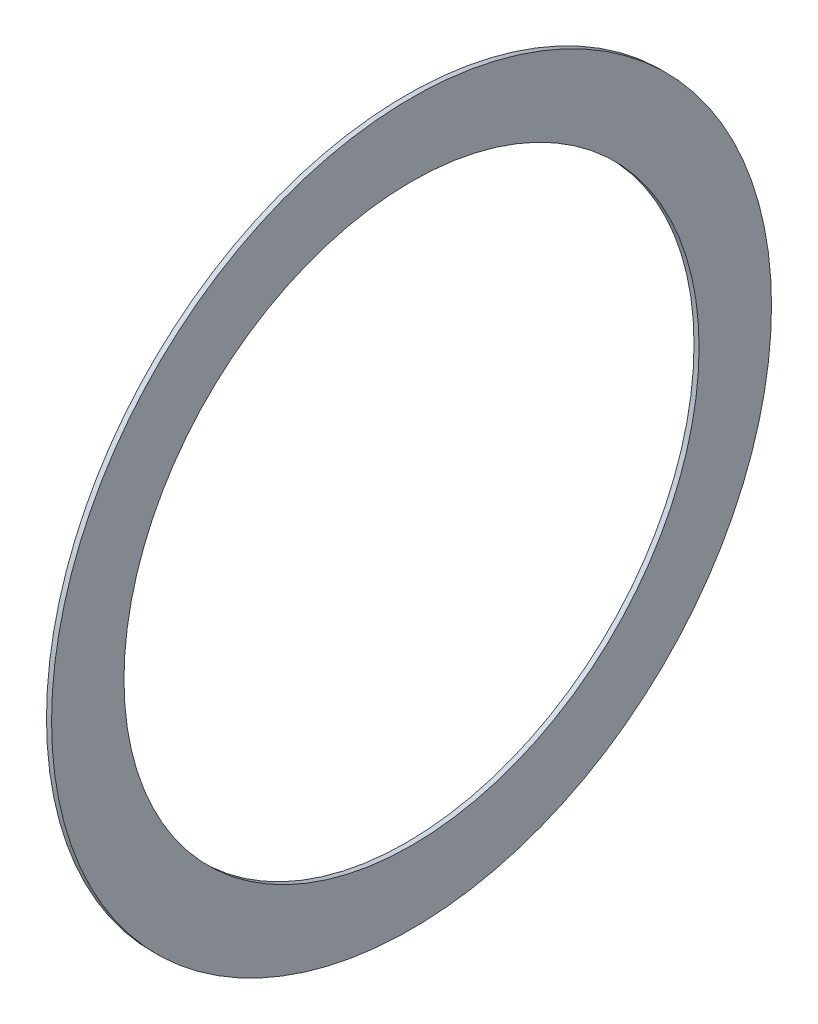
ISO-10303-21;
HEADER;
FILE_DESCRIPTION(('STEP AP214'),'2;1');
FILE_NAME('part.step','',(''),(''),'','','');
FILE_SCHEMA(('AUTOMOTIVE_DESIGN { 1 0 10303 214 1 1 1 1 }'));
ENDSEC;
DATA;
#1=APPLICATION_CONTEXT('core data for automotive mechanical design processes');
#2=APPLICATION_PROTOCOL_DEFINITION('international standard','automotive_design',2000,#1);
#3=PRODUCT_CONTEXT('',#1,'mechanical');
#4=PRODUCT('Part','Part','',(#3));
#5=PRODUCT_RELATED_PRODUCT_CATEGORY('part','',(#4));
#6=PRODUCT_DEFINITION_FORMATION('','',#4);
#7=PRODUCT_DEFINITION_CONTEXT('part definition',#1,'design');
#8=PRODUCT_DEFINITION('design','',#6,#7);
#9=PRODUCT_DEFINITION_SHAPE('','',#8);
#10=(LENGTH_UNIT() NAMED_UNIT(*) SI_UNIT(.MILLI.,.METRE.));
#11=(NAMED_UNIT(*) PLANE_ANGLE_UNIT() SI_UNIT($,.RADIAN.));
#12=(NAMED_UNIT(*) SI_UNIT($,.STERADIAN.) SOLID_ANGLE_UNIT());
#13=UNCERTAINTY_MEASURE_WITH_UNIT(LENGTH_MEASURE(1.E-05),#10,'distance_accuracy_value','');
#14=(GEOMETRIC_REPRESENTATION_CONTEXT(3) GLOBAL_UNCERTAINTY_ASSIGNED_CONTEXT((#13)) GLOBAL_UNIT_ASSIGNED_CONTEXT((#10,
#11,#12)) REPRESENTATION_CONTEXT('',''));
#15=CARTESIAN_POINT('',(0.,0.,0.));
#16=DIRECTION('',(0.,0.,1.));
#17=DIRECTION('',(1.,0.,0.));
#18=AXIS2_PLACEMENT_3D('',#15,#16,#17);
#19=CARTESIAN_POINT('',(0.2415,0.,0.));
#20=DIRECTION('',(1.,0.,0.));
#21=DIRECTION('',(0.,0.,-1.));
#22=AXIS2_PLACEMENT_3D('',#19,#20,#21);
#23=CYLINDRICAL_SURFACE('',#22,17.15);
#24=CARTESIAN_POINT('',(0.2415,0.,0.));
#25=DIRECTION('',(1.,0.,0.));
#26=DIRECTION('',(0.,0.,-1.));
#27=AXIS2_PLACEMENT_3D('',#24,#25,#26);
#28=CIRCLE('',#27,17.15);
#29=CARTESIAN_POINT('',(0.2415,0.,-17.15));
#30=VERTEX_POINT('',#29);
#31=EDGE_CURVE('E11',#30,#30,#28,.T.);
#32=ORIENTED_EDGE('',*,*,#31,.F.);
#33=EDGE_LOOP('',(#32));
#34=FACE_BOUND('',#33,.T.);
#35=CARTESIAN_POINT('',(0.,0.,0.));
#36=DIRECTION('',(1.,0.,0.));
#37=DIRECTION('',(0.,0.,-1.));
#38=AXIS2_PLACEMENT_3D('',#35,#36,#37);
#39=CIRCLE('',#38,17.15);
#40=CARTESIAN_POINT('',(0.,0.,-17.15));
#41=VERTEX_POINT('',#40);
#42=EDGE_CURVE('E45',#41,#41,#39,.T.);
#43=ORIENTED_EDGE('',*,*,#42,.T.);
#44=EDGE_LOOP('',(#43));
#45=FACE_BOUND('',#44,.T.);
#46=ADVANCED_FACE('F16',(#34,#45),#23,.T.);
#47=CARTESIAN_POINT('',(0.2415,13.7,0.));
#48=DIRECTION('',(1.,0.,0.));
#49=DIRECTION('',(0.,1.,0.));
#50=AXIS2_PLACEMENT_3D('',#47,#48,#49);
#51=PLANE('',#50);
#52=CARTESIAN_POINT('',(0.2415,0.,0.));
#53=DIRECTION('',(1.,0.,0.));
#54=DIRECTION('',(0.,0.,-1.));
#55=AXIS2_PLACEMENT_3D('',#52,#53,#54);
#56=CIRCLE('',#55,13.7);
#57=CARTESIAN_POINT('',(0.2415,0.,-13.7));
#58=VERTEX_POINT('',#57);
#59=EDGE_CURVE('E25',#58,#58,#56,.T.);
#60=ORIENTED_EDGE('',*,*,#59,.F.);
#61=EDGE_LOOP('',(#60));
#62=FACE_BOUND('',#61,.T.);
#63=ORIENTED_EDGE('',*,*,#31,.T.);
#64=EDGE_LOOP('',(#63));
#65=FACE_BOUND('',#64,.T.);
#66=ADVANCED_FACE('F65',(#62,#65),#51,.T.);
#67=CARTESIAN_POINT('',(0.2415,0.,0.));
#68=DIRECTION('',(1.,0.,0.));
#69=DIRECTION('',(0.,0.,-1.));
#70=AXIS2_PLACEMENT_3D('',#67,#68,#69);
#71=CYLINDRICAL_SURFACE('',#70,13.7);
#72=CARTESIAN_POINT('',(0.,0.,0.));
#73=DIRECTION('',(1.,0.,0.));
#74=DIRECTION('',(0.,0.,-1.));
#75=AXIS2_PLACEMENT_3D('',#72,#73,#74);
#76=CIRCLE('',#75,13.7);
#77=CARTESIAN_POINT('',(0.,0.,-13.7));
#78=VERTEX_POINT('',#77);
#79=EDGE_CURVE('E48',#78,#78,#76,.T.);
#80=ORIENTED_EDGE('',*,*,#79,.F.);
#81=EDGE_LOOP('',(#80));
#82=FACE_BOUND('',#81,.T.);
#83=ORIENTED_EDGE('',*,*,#59,.T.);
#84=EDGE_LOOP('',(#83));
#85=FACE_BOUND('',#84,.T.);
#86=ADVANCED_FACE('F62',(#82,#85),#71,.F.);
#87=CARTESIAN_POINT('',(0.,17.15,0.));
#88=DIRECTION('',(-1.,0.,0.));
#89=DIRECTION('',(0.,0.,1.));
#90=AXIS2_PLACEMENT_3D('',#87,#88,#89);
#91=PLANE('',#90);
#92=ORIENTED_EDGE('',*,*,#42,.F.);
#93=EDGE_LOOP('',(#92));
#94=FACE_BOUND('',#93,.T.);
#95=ORIENTED_EDGE('',*,*,#79,.T.);
#96=EDGE_LOOP('',(#95));
#97=FACE_BOUND('',#96,.T.);
#98=ADVANCED_FACE('F60',(#94,#97),#91,.T.);
#99=CLOSED_SHELL('',(#46,#66,#86,#98));
#100=MANIFOLD_SOLID_BREP('B1',#99);
#101=ADVANCED_BREP_SHAPE_REPRESENTATION('',(#18,#100),#14);
#102=SHAPE_DEFINITION_REPRESENTATION(#9,#101);
ENDSEC;
END-ISO-10303-21;
